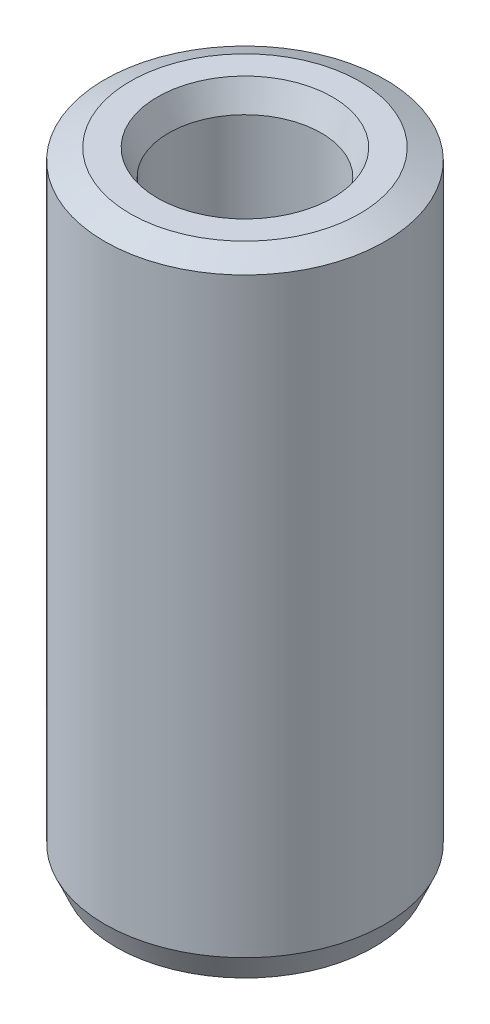
ISO-10303-21;
HEADER;
FILE_DESCRIPTION(('STEP AP214'),'2;1');
FILE_NAME('part.step','',(''),(''),'','','');
FILE_SCHEMA(('AUTOMOTIVE_DESIGN { 1 0 10303 214 1 1 1 1 }'));
ENDSEC;
DATA;
#1=APPLICATION_CONTEXT('core data for automotive mechanical design processes');
#2=APPLICATION_PROTOCOL_DEFINITION('international standard','automotive_design',2000,#1);
#3=PRODUCT_CONTEXT('',#1,'mechanical');
#4=PRODUCT('Part','Part','',(#3));
#5=PRODUCT_RELATED_PRODUCT_CATEGORY('part','',(#4));
#6=PRODUCT_DEFINITION_FORMATION('','',#4);
#7=PRODUCT_DEFINITION_CONTEXT('part definition',#1,'design');
#8=PRODUCT_DEFINITION('design','',#6,#7);
#9=PRODUCT_DEFINITION_SHAPE('','',#8);
#10=(LENGTH_UNIT() NAMED_UNIT(*) SI_UNIT(.MILLI.,.METRE.));
#11=(NAMED_UNIT(*) PLANE_ANGLE_UNIT() SI_UNIT($,.RADIAN.));
#12=(NAMED_UNIT(*) SI_UNIT($,.STERADIAN.) SOLID_ANGLE_UNIT());
#13=UNCERTAINTY_MEASURE_WITH_UNIT(LENGTH_MEASURE(1.E-05),#10,'distance_accuracy_value','');
#14=(GEOMETRIC_REPRESENTATION_CONTEXT(3) GLOBAL_UNCERTAINTY_ASSIGNED_CONTEXT((#13)) GLOBAL_UNIT_ASSIGNED_CONTEXT((#10,
#11,#12)) REPRESENTATION_CONTEXT('',''));
#15=CARTESIAN_POINT('',(0.,0.,0.));
#16=DIRECTION('',(0.,0.,1.));
#17=DIRECTION('',(1.,0.,0.));
#18=AXIS2_PLACEMENT_3D('',#15,#16,#17);
#19=CARTESIAN_POINT('',(0.,33.5834797072785,0.));
#20=DIRECTION('',(0.,-1.,0.));
#21=DIRECTION('',(0.,0.,-1.));
#22=AXIS2_PLACEMENT_3D('',#19,#20,#21);
#23=CYLINDRICAL_SURFACE('',#22,7.5);
#24=CARTESIAN_POINT('',(0.,1.36460572000144,0.));
#25=DIRECTION('',(0.,1.,0.));
#26=DIRECTION('',(0.,0.,1.));
#27=AXIS2_PLACEMENT_3D('',#24,#25,#26);
#28=CIRCLE('',#27,7.5);
#29=CARTESIAN_POINT('',(0.,1.36460572000144,7.5));
#30=VERTEX_POINT('',#29);
#31=EDGE_CURVE('E10',#30,#30,#28,.T.);
#32=ORIENTED_EDGE('',*,*,#31,.T.);
#33=EDGE_LOOP('',(#32));
#34=FACE_BOUND('',#33,.T.);
#35=CARTESIAN_POINT('',(0.,32.9810434141502,0.));
#36=DIRECTION('',(0.,1.,0.));
#37=DIRECTION('',(0.,0.,1.));
#38=AXIS2_PLACEMENT_3D('',#35,#36,#37);
#39=CIRCLE('',#38,7.5);
#40=CARTESIAN_POINT('',(0.,32.9810434141502,7.5));
#41=VERTEX_POINT('',#40);
#42=EDGE_CURVE('E50',#41,#41,#39,.F.);
#43=ORIENTED_EDGE('',*,*,#42,.T.);
#44=EDGE_LOOP('',(#43));
#45=FACE_BOUND('',#44,.T.);
#46=ADVANCED_FACE('F39',(#34,#45),#23,.T.);
#47=CARTESIAN_POINT('',(0.,33.5834797072785,0.));
#48=DIRECTION('',(0.,1.,0.));
#49=DIRECTION('',(0.,0.,1.));
#50=AXIS2_PLACEMENT_3D('',#47,#48,#49);
#51=PLANE('',#50);
#52=CARTESIAN_POINT('',(0.,33.5834797072785,0.));
#53=DIRECTION('',(0.,1.,0.));
#54=DIRECTION('',(0.,0.,1.));
#55=AXIS2_PLACEMENT_3D('',#52,#53,#54);
#56=CIRCLE('',#55,4.68212336162969);
#57=CARTESIAN_POINT('',(0.,33.5834797072785,4.68212336162969));
#58=VERTEX_POINT('',#57);
#59=EDGE_CURVE('E58',#58,#58,#56,.F.);
#60=ORIENTED_EDGE('',*,*,#59,.T.);
#61=EDGE_LOOP('',(#60));
#62=FACE_BOUND('',#61,.T.);
#63=CARTESIAN_POINT('',(0.,33.5834797072785,0.));
#64=DIRECTION('',(0.,1.,0.));
#65=DIRECTION('',(0.,0.,1.));
#66=AXIS2_PLACEMENT_3D('',#63,#64,#65);
#67=CIRCLE('',#66,6.13539427999852);
#68=CARTESIAN_POINT('',(0.,33.5834797072785,6.13539427999852));
#69=VERTEX_POINT('',#68);
#70=EDGE_CURVE('E61',#69,#69,#67,.T.);
#71=ORIENTED_EDGE('',*,*,#70,.T.);
#72=EDGE_LOOP('',(#71));
#73=FACE_BOUND('',#72,.T.);
#74=ADVANCED_FACE('F88',(#62,#73),#51,.T.);
#75=CARTESIAN_POINT('',(0.,0.,0.));
#76=DIRECTION('',(0.,1.,0.));
#77=DIRECTION('',(0.,0.,1.));
#78=AXIS2_PLACEMENT_3D('',#75,#76,#77);
#79=PLANE('',#78);
#80=CARTESIAN_POINT('',(0.,0.,0.));
#81=DIRECTION('',(0.,1.,0.));
#82=DIRECTION('',(0.,0.,1.));
#83=AXIS2_PLACEMENT_3D('',#80,#81,#82);
#84=CIRCLE('',#83,5.44429278850282);
#85=CARTESIAN_POINT('',(0.,0.,5.44429278850282));
#86=VERTEX_POINT('',#85);
#87=EDGE_CURVE('E51',#86,#86,#84,.T.);
#88=ORIENTED_EDGE('',*,*,#87,.T.);
#89=EDGE_LOOP('',(#88));
#90=FACE_BOUND('',#89,.T.);
#91=CARTESIAN_POINT('',(0.,0.,0.));
#92=DIRECTION('',(0.,1.,0.));
#93=DIRECTION('',(0.,0.,1.));
#94=AXIS2_PLACEMENT_3D('',#91,#92,#93);
#95=CIRCLE('',#94,6.89756370687168);
#96=CARTESIAN_POINT('',(0.,0.,6.89756370687168));
#97=VERTEX_POINT('',#96);
#98=EDGE_CURVE('E54',#97,#97,#95,.F.);
#99=ORIENTED_EDGE('',*,*,#98,.T.);
#100=EDGE_LOOP('',(#99));
#101=FACE_BOUND('',#100,.T.);
#102=ADVANCED_FACE('F83',(#90,#101),#79,.F.);
#103=CARTESIAN_POINT('',(0.,33.5834797072785,0.));
#104=DIRECTION('',(0.,-1.,0.));
#105=DIRECTION('',(0.,0.,-1.));
#106=AXIS2_PLACEMENT_3D('',#103,#104,#105);
#107=CYLINDRICAL_SURFACE('',#106,4.07968706850135);
#108=CARTESIAN_POINT('',(0.,32.218873987277,0.));
#109=DIRECTION('',(0.,1.,0.));
#110=DIRECTION('',(0.,0.,1.));
#111=AXIS2_PLACEMENT_3D('',#108,#109,#110);
#112=CIRCLE('',#111,4.07968706850135);
#113=CARTESIAN_POINT('',(0.,32.218873987277,4.07968706850135));
#114=VERTEX_POINT('',#113);
#115=EDGE_CURVE('E67',#114,#114,#112,.T.);
#116=ORIENTED_EDGE('',*,*,#115,.T.);
#117=EDGE_LOOP('',(#116));
#118=FACE_BOUND('',#117,.T.);
#119=CARTESIAN_POINT('',(0.,0.602436293128339,0.));
#120=DIRECTION('',(0.,1.,0.));
#121=DIRECTION('',(0.,0.,1.));
#122=AXIS2_PLACEMENT_3D('',#119,#120,#121);
#123=CIRCLE('',#122,4.07968706850135);
#124=CARTESIAN_POINT('',(0.,0.602436293128339,4.07968706850135));
#125=VERTEX_POINT('',#124);
#126=EDGE_CURVE('E69',#125,#125,#123,.F.);
#127=ORIENTED_EDGE('',*,*,#126,.T.);
#128=EDGE_LOOP('',(#127));
#129=FACE_BOUND('',#128,.T.);
#130=ADVANCED_FACE('F71',(#118,#129),#107,.F.);
#131=CARTESIAN_POINT('',(0.,32.218873987277,0.));
#132=DIRECTION('',(0.,1.,0.));
#133=DIRECTION('',(0.,0.,1.));
#134=AXIS2_PLACEMENT_3D('',#131,#132,#133);
#135=CONICAL_SURFACE('',#134,4.07968706850135,0.415740109427734);
#136=ORIENTED_EDGE('',*,*,#59,.F.);
#137=EDGE_LOOP('',(#136));
#138=FACE_BOUND('',#137,.T.);
#139=ORIENTED_EDGE('',*,*,#115,.F.);
#140=EDGE_LOOP('',(#139));
#141=FACE_BOUND('',#140,.T.);
#142=ADVANCED_FACE('F77',(#138,#141),#135,.F.);
#143=CARTESIAN_POINT('',(0.,0.,0.));
#144=DIRECTION('',(0.,-1.,0.));
#145=DIRECTION('',(0.,0.,-1.));
#146=AXIS2_PLACEMENT_3D('',#143,#144,#145);
#147=CONICAL_SURFACE('',#146,5.44429278850282,1.15505621736716);
#148=ORIENTED_EDGE('',*,*,#126,.F.);
#149=EDGE_LOOP('',(#148));
#150=FACE_BOUND('',#149,.T.);
#151=ORIENTED_EDGE('',*,*,#87,.F.);
#152=EDGE_LOOP('',(#151));
#153=FACE_BOUND('',#152,.T.);
#154=ADVANCED_FACE('F73',(#150,#153),#147,.F.);
#155=CARTESIAN_POINT('',(0.,1.36460572000144,0.));
#156=DIRECTION('',(0.,1.,0.));
#157=DIRECTION('',(0.,0.,1.));
#158=AXIS2_PLACEMENT_3D('',#155,#156,#157);
#159=CONICAL_SURFACE('',#158,7.5,0.415740109427734);
#160=ORIENTED_EDGE('',*,*,#98,.F.);
#161=EDGE_LOOP('',(#160));
#162=FACE_BOUND('',#161,.T.);
#163=ORIENTED_EDGE('',*,*,#31,.F.);
#164=EDGE_LOOP('',(#163));
#165=FACE_BOUND('',#164,.T.);
#166=ADVANCED_FACE('F76',(#162,#165),#159,.T.);
#167=CARTESIAN_POINT('',(0.,33.5834797072785,0.));
#168=DIRECTION('',(0.,-1.,0.));
#169=DIRECTION('',(0.,0.,-1.));
#170=AXIS2_PLACEMENT_3D('',#167,#168,#169);
#171=CONICAL_SURFACE('',#170,6.13539427999852,1.15505621736716);
#172=ORIENTED_EDGE('',*,*,#42,.F.);
#173=EDGE_LOOP('',(#172));
#174=FACE_BOUND('',#173,.T.);
#175=ORIENTED_EDGE('',*,*,#70,.F.);
#176=EDGE_LOOP('',(#175));
#177=FACE_BOUND('',#176,.T.);
#178=ADVANCED_FACE('F45',(#174,#177),#171,.T.);
#179=CLOSED_SHELL('',(#46,#74,#102,#130,#142,#154,#166,#178));
#180=MANIFOLD_SOLID_BREP('B2',#179);
#181=ADVANCED_BREP_SHAPE_REPRESENTATION('',(#18,#180),#14);
#182=SHAPE_DEFINITION_REPRESENTATION(#9,#181);
ENDSEC;
END-ISO-10303-21;
